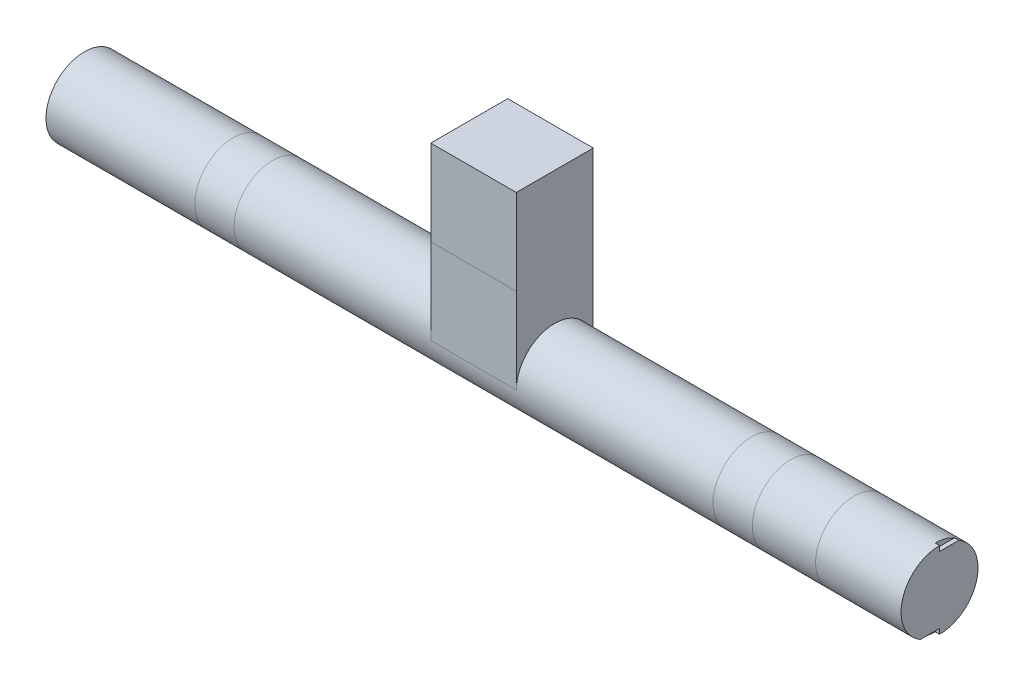
ISO-10303-21;
HEADER;
FILE_DESCRIPTION(('STEP AP214'),'2;1');
FILE_NAME('part.step','',(''),(''),'','','');
FILE_SCHEMA(('AUTOMOTIVE_DESIGN { 1 0 10303 214 1 1 1 1 }'));
ENDSEC;
DATA;
#1=APPLICATION_CONTEXT('core data for automotive mechanical design processes');
#2=APPLICATION_PROTOCOL_DEFINITION('international standard','automotive_design',2000,#1);
#3=PRODUCT_CONTEXT('',#1,'mechanical');
#4=PRODUCT('Part','Part','',(#3));
#5=PRODUCT_RELATED_PRODUCT_CATEGORY('part','',(#4));
#6=PRODUCT_DEFINITION_FORMATION('','',#4);
#7=PRODUCT_DEFINITION_CONTEXT('part definition',#1,'design');
#8=PRODUCT_DEFINITION('design','',#6,#7);
#9=PRODUCT_DEFINITION_SHAPE('','',#8);
#10=(LENGTH_UNIT() NAMED_UNIT(*) SI_UNIT(.MILLI.,.METRE.));
#11=(NAMED_UNIT(*) PLANE_ANGLE_UNIT() SI_UNIT($,.RADIAN.));
#12=(NAMED_UNIT(*) SI_UNIT($,.STERADIAN.) SOLID_ANGLE_UNIT());
#13=UNCERTAINTY_MEASURE_WITH_UNIT(LENGTH_MEASURE(1.E-05),#10,'distance_accuracy_value','');
#14=(GEOMETRIC_REPRESENTATION_CONTEXT(3) GLOBAL_UNCERTAINTY_ASSIGNED_CONTEXT((#13)) GLOBAL_UNIT_ASSIGNED_CONTEXT((#10,
#11,#12)) REPRESENTATION_CONTEXT('',''));
#15=CARTESIAN_POINT('',(0.,0.,0.));
#16=DIRECTION('',(0.,0.,1.));
#17=DIRECTION('',(1.,0.,0.));
#18=AXIS2_PLACEMENT_3D('',#15,#16,#17);
#19=CARTESIAN_POINT('',(50.,200.,45.));
#20=DIRECTION('',(0.,0.,-1.));
#21=DIRECTION('',(0.,1.,0.));
#22=AXIS2_PLACEMENT_3D('',#19,#20,#21);
#23=PLANE('',#22);
#24=DIRECTION('',(1.,0.,0.));
#25=VECTOR('',#24,1.);
#26=CARTESIAN_POINT('',(50.0000000000001,100.,45.));
#27=LINE('',#26,#25);
#28=CARTESIAN_POINT('',(-50.,100.,45.));
#29=VERTEX_POINT('',#28);
#30=CARTESIAN_POINT('',(50.,100.,45.));
#31=VERTEX_POINT('',#30);
#32=EDGE_CURVE('E297',#29,#31,#27,.T.);
#33=ORIENTED_EDGE('',*,*,#32,.F.);
#34=DIRECTION('',(0.,-1.,0.));
#35=VECTOR('',#34,1.);
#36=CARTESIAN_POINT('',(-50.,200.,45.));
#37=LINE('',#36,#35);
#38=CARTESIAN_POINT('',(-50.,0.,45.));
#39=VERTEX_POINT('',#38);
#40=EDGE_CURVE('E239',#29,#39,#37,.T.);
#41=ORIENTED_EDGE('',*,*,#40,.T.);
#42=DIRECTION('',(-1.,0.,0.));
#43=VECTOR('',#42,1.);
#44=CARTESIAN_POINT('',(50.,0.,45.));
#45=LINE('',#44,#43);
#46=CARTESIAN_POINT('',(50.,0.,45.));
#47=VERTEX_POINT('',#46);
#48=EDGE_CURVE('E256',#47,#39,#45,.T.);
#49=ORIENTED_EDGE('',*,*,#48,.F.);
#50=DIRECTION('',(0.,-1.,0.));
#51=VECTOR('',#50,1.);
#52=CARTESIAN_POINT('',(50.,200.,45.));
#53=LINE('',#52,#51);
#54=EDGE_CURVE('E229',#31,#47,#53,.T.);
#55=ORIENTED_EDGE('',*,*,#54,.F.);
#56=EDGE_LOOP('',(#33,#41,#49,#55));
#57=FACE_BOUND('',#56,.T.);
#58=ADVANCED_FACE('F49',(#57),#23,.F.);
#59=CARTESIAN_POINT('',(500.,0.,0.));
#60=DIRECTION('',(-1.,0.,0.));
#61=DIRECTION('',(0.,0.,1.));
#62=AXIS2_PLACEMENT_3D('',#59,#60,#61);
#63=CYLINDRICAL_SURFACE('',#62,45.);
#64=CARTESIAN_POINT('',(280.,0.,0.));
#65=DIRECTION('',(1.,0.,0.));
#66=DIRECTION('',(0.,0.,-1.));
#67=AXIS2_PLACEMENT_3D('',#64,#65,#66);
#68=CIRCLE('',#67,45.);
#69=CARTESIAN_POINT('',(280.,-45.,0.));
#70=VERTEX_POINT('',#69);
#71=CARTESIAN_POINT('',(280.,45.,0.));
#72=VERTEX_POINT('',#71);
#73=EDGE_CURVE('E286',#70,#72,#68,.T.);
#74=ORIENTED_EDGE('',*,*,#73,.T.);
#75=EDGE_CURVE('E291',#72,#70,#68,.T.);
#76=ORIENTED_EDGE('',*,*,#75,.T.);
#77=EDGE_LOOP('',(#74,#76));
#78=FACE_BOUND('',#77,.T.);
#79=CARTESIAN_POINT('',(326.,0.,0.));
#80=DIRECTION('',(1.,0.,0.));
#81=DIRECTION('',(0.,1.,0.));
#82=AXIS2_PLACEMENT_3D('',#79,#80,#81);
#83=CIRCLE('',#82,45.);
#84=CARTESIAN_POINT('',(326.,45.,0.));
#85=VERTEX_POINT('',#84);
#86=CARTESIAN_POINT('',(326.,-45.,0.));
#87=VERTEX_POINT('',#86);
#88=EDGE_CURVE('E296',#85,#87,#83,.T.);
#89=ORIENTED_EDGE('',*,*,#88,.F.);
#90=EDGE_CURVE('E292',#87,#85,#83,.T.);
#91=ORIENTED_EDGE('',*,*,#90,.F.);
#92=EDGE_LOOP('',(#89,#91));
#93=FACE_BOUND('',#92,.T.);
#94=ADVANCED_FACE('F321',(#78,#93),#63,.T.);
#95=DIRECTION('',(-1.,0.,0.));
#96=VECTOR('',#95,1.);
#97=CARTESIAN_POINT('',(50.,0.,-45.));
#98=LINE('',#97,#96);
#99=CARTESIAN_POINT('',(50.,0.,-45.));
#100=VERTEX_POINT('',#99);
#101=CARTESIAN_POINT('',(-50.,0.,-45.));
#102=VERTEX_POINT('',#101);
#103=EDGE_CURVE('E253',#100,#102,#98,.T.);
#104=ORIENTED_EDGE('',*,*,#103,.F.);
#105=CARTESIAN_POINT('',(50.,0.,0.));
#106=DIRECTION('',(1.,0.,0.));
#107=DIRECTION('',(0.,0.,-1.));
#108=AXIS2_PLACEMENT_3D('',#105,#106,#107);
#109=CIRCLE('',#108,45.);
#110=EDGE_CURVE('E275',#100,#47,#109,.T.);
#111=ORIENTED_EDGE('',*,*,#110,.T.);
#112=ORIENTED_EDGE('',*,*,#48,.T.);
#113=CARTESIAN_POINT('',(-50.,0.,0.));
#114=DIRECTION('',(1.,0.,0.));
#115=DIRECTION('',(0.,0.,-1.));
#116=AXIS2_PLACEMENT_3D('',#113,#114,#115);
#117=CIRCLE('',#116,45.);
#118=EDGE_CURVE('E352',#102,#39,#117,.T.);
#119=ORIENTED_EDGE('',*,*,#118,.F.);
#120=EDGE_LOOP('',(#104,#111,#112,#119));
#121=FACE_BOUND('',#120,.T.);
#122=CARTESIAN_POINT('',(-280.,0.,0.));
#123=DIRECTION('',(1.,0.,0.));
#124=DIRECTION('',(0.,0.,-1.));
#125=AXIS2_PLACEMENT_3D('',#122,#123,#124);
#126=CIRCLE('',#125,45.);
#127=CARTESIAN_POINT('',(-280.,-45.,0.));
#128=VERTEX_POINT('',#127);
#129=CARTESIAN_POINT('',(-280.,45.,0.));
#130=VERTEX_POINT('',#129);
#131=EDGE_CURVE('E281',#128,#130,#126,.T.);
#132=ORIENTED_EDGE('',*,*,#131,.T.);
#133=EDGE_CURVE('E285',#130,#128,#126,.T.);
#134=ORIENTED_EDGE('',*,*,#133,.T.);
#135=EDGE_LOOP('',(#132,#134));
#136=FACE_BOUND('',#135,.T.);
#137=ORIENTED_EDGE('',*,*,#75,.F.);
#138=ORIENTED_EDGE('',*,*,#73,.F.);
#139=EDGE_LOOP('',(#137,#138));
#140=FACE_BOUND('',#139,.T.);
#141=ADVANCED_FACE('F328',(#121,#136,#140),#63,.T.);
#142=CARTESIAN_POINT('',(-326.,0.,0.));
#143=DIRECTION('',(1.,0.,0.));
#144=DIRECTION('',(0.,0.,-1.));
#145=AXIS2_PLACEMENT_3D('',#142,#143,#144);
#146=CIRCLE('',#145,45.);
#147=CARTESIAN_POINT('',(-326.,-45.,0.));
#148=VERTEX_POINT('',#147);
#149=CARTESIAN_POINT('',(-326.,45.,0.));
#150=VERTEX_POINT('',#149);
#151=EDGE_CURVE('E269',#148,#150,#146,.T.);
#152=ORIENTED_EDGE('',*,*,#151,.T.);
#153=EDGE_CURVE('E274',#150,#148,#146,.T.);
#154=ORIENTED_EDGE('',*,*,#153,.T.);
#155=EDGE_LOOP('',(#152,#154));
#156=FACE_BOUND('',#155,.T.);
#157=ORIENTED_EDGE('',*,*,#133,.F.);
#158=ORIENTED_EDGE('',*,*,#131,.F.);
#159=EDGE_LOOP('',(#157,#158));
#160=FACE_BOUND('',#159,.T.);
#161=ADVANCED_FACE('F450',(#156,#160),#63,.T.);
#162=ORIENTED_EDGE('',*,*,#90,.T.);
#163=ORIENTED_EDGE('',*,*,#88,.T.);
#164=EDGE_LOOP('',(#162,#163));
#165=FACE_BOUND('',#164,.T.);
#166=CARTESIAN_POINT('',(400.,0.,0.));
#167=DIRECTION('',(1.,0.,0.));
#168=DIRECTION('',(0.,0.,-1.));
#169=AXIS2_PLACEMENT_3D('',#166,#167,#168);
#170=CIRCLE('',#169,45.);
#171=CARTESIAN_POINT('',(400.,45.,0.));
#172=VERTEX_POINT('',#171);
#173=CARTESIAN_POINT('',(400.,-45.,0.));
#174=VERTEX_POINT('',#173);
#175=EDGE_CURVE('E280',#172,#174,#170,.T.);
#176=ORIENTED_EDGE('',*,*,#175,.F.);
#177=EDGE_CURVE('E276',#174,#172,#170,.T.);
#178=ORIENTED_EDGE('',*,*,#177,.F.);
#179=EDGE_LOOP('',(#176,#178));
#180=FACE_BOUND('',#179,.T.);
#181=ADVANCED_FACE('F440',(#165,#180),#63,.T.);
#182=CARTESIAN_POINT('',(-500.,0.,0.));
#183=DIRECTION('',(1.,0.,0.));
#184=DIRECTION('',(0.,0.,-1.));
#185=AXIS2_PLACEMENT_3D('',#182,#183,#184);
#186=CIRCLE('',#185,45.);
#187=CARTESIAN_POINT('',(-500.,0.,-45.));
#188=VERTEX_POINT('',#187);
#189=EDGE_CURVE('E259',#188,#188,#186,.T.);
#190=ORIENTED_EDGE('',*,*,#189,.T.);
#191=EDGE_LOOP('',(#190));
#192=FACE_BOUND('',#191,.T.);
#193=ORIENTED_EDGE('',*,*,#153,.F.);
#194=ORIENTED_EDGE('',*,*,#151,.F.);
#195=EDGE_LOOP('',(#193,#194));
#196=FACE_BOUND('',#195,.T.);
#197=ADVANCED_FACE('F401',(#192,#196),#63,.T.);
#198=ORIENTED_EDGE('',*,*,#177,.T.);
#199=ORIENTED_EDGE('',*,*,#175,.T.);
#200=EDGE_LOOP('',(#198,#199));
#201=FACE_BOUND('',#200,.T.);
#202=CARTESIAN_POINT('',(495.,0.,0.));
#203=DIRECTION('',(1.,0.,0.));
#204=DIRECTION('',(0.,0.,-1.));
#205=AXIS2_PLACEMENT_3D('',#202,#203,#204);
#206=CIRCLE('',#205,45.);
#207=CARTESIAN_POINT('',(495.,39.,-22.4499443206436));
#208=VERTEX_POINT('',#207);
#209=CARTESIAN_POINT('',(495.,45.,0.));
#210=VERTEX_POINT('',#209);
#211=EDGE_CURVE('E12',#208,#210,#206,.T.);
#212=ORIENTED_EDGE('',*,*,#211,.F.);
#213=DIRECTION('',(1.,0.,0.));
#214=VECTOR('',#213,1.);
#215=CARTESIAN_POINT('',(495.,39.,-22.4499443206436));
#216=LINE('',#215,#214);
#217=CARTESIAN_POINT('',(500.,39.,-22.4499443206436));
#218=VERTEX_POINT('',#217);
#219=EDGE_CURVE('E204',#208,#218,#216,.T.);
#220=ORIENTED_EDGE('',*,*,#219,.T.);
#221=CARTESIAN_POINT('',(500.,0.,0.));
#222=DIRECTION('',(1.,0.,0.));
#223=DIRECTION('',(0.,0.,-1.));
#224=AXIS2_PLACEMENT_3D('',#221,#222,#223);
#225=CIRCLE('',#224,45.);
#226=CARTESIAN_POINT('',(500.,-45.,0.));
#227=VERTEX_POINT('',#226);
#228=EDGE_CURVE('E260',#227,#218,#225,.T.);
#229=ORIENTED_EDGE('',*,*,#228,.F.);
#230=DIRECTION('',(1.,0.,0.));
#231=VECTOR('',#230,1.);
#232=CARTESIAN_POINT('',(495.,-45.,0.));
#233=LINE('',#232,#231);
#234=CARTESIAN_POINT('',(495.,-45.,0.));
#235=VERTEX_POINT('',#234);
#236=EDGE_CURVE('E67',#235,#227,#233,.T.);
#237=ORIENTED_EDGE('',*,*,#236,.F.);
#238=CARTESIAN_POINT('',(495.,0.,0.));
#239=DIRECTION('',(1.,0.,0.));
#240=DIRECTION('',(0.,0.,-1.));
#241=AXIS2_PLACEMENT_3D('',#238,#239,#240);
#242=CIRCLE('',#241,45.);
#243=CARTESIAN_POINT('',(495.,-39.,22.4499443206436));
#244=VERTEX_POINT('',#243);
#245=EDGE_CURVE('E57',#244,#235,#242,.T.);
#246=ORIENTED_EDGE('',*,*,#245,.F.);
#247=DIRECTION('',(1.,0.,0.));
#248=VECTOR('',#247,1.);
#249=CARTESIAN_POINT('',(495.,-39.,22.4499443206436));
#250=LINE('',#249,#248);
#251=CARTESIAN_POINT('',(500.,-39.,22.4499443206436));
#252=VERTEX_POINT('',#251);
#253=EDGE_CURVE('E219',#244,#252,#250,.T.);
#254=ORIENTED_EDGE('',*,*,#253,.T.);
#255=CARTESIAN_POINT('',(500.,45.,0.));
#256=VERTEX_POINT('',#255);
#257=EDGE_CURVE('E202',#256,#252,#225,.T.);
#258=ORIENTED_EDGE('',*,*,#257,.F.);
#259=DIRECTION('',(1.,0.,0.));
#260=VECTOR('',#259,1.);
#261=CARTESIAN_POINT('',(495.,45.,0.));
#262=LINE('',#261,#260);
#263=EDGE_CURVE('E77',#210,#256,#262,.T.);
#264=ORIENTED_EDGE('',*,*,#263,.F.);
#265=EDGE_LOOP('',(#212,#220,#229,#237,#246,#254,#258,#264));
#266=FACE_BOUND('',#265,.T.);
#267=ADVANCED_FACE('F51',(#201,#266),#63,.T.);
#268=CARTESIAN_POINT('',(500.,0.,0.));
#269=DIRECTION('',(1.,0.,0.));
#270=DIRECTION('',(0.,0.,-1.));
#271=AXIS2_PLACEMENT_3D('',#268,#269,#270);
#272=PLANE('',#271);
#273=DIRECTION('',(0.,0.,-1.));
#274=VECTOR('',#273,1.);
#275=CARTESIAN_POINT('',(500.,39.,-22.4499443206436));
#276=LINE('',#275,#274);
#277=CARTESIAN_POINT('',(500.,39.,0.));
#278=VERTEX_POINT('',#277);
#279=EDGE_CURVE('E197',#278,#218,#276,.T.);
#280=ORIENTED_EDGE('',*,*,#279,.F.);
#281=DIRECTION('',(0.,-1.,0.));
#282=VECTOR('',#281,1.);
#283=CARTESIAN_POINT('',(500.,39.,0.));
#284=LINE('',#283,#282);
#285=EDGE_CURVE('E221',#256,#278,#284,.T.);
#286=ORIENTED_EDGE('',*,*,#285,.F.);
#287=ORIENTED_EDGE('',*,*,#257,.T.);
#288=DIRECTION('',(0.,0.,1.));
#289=VECTOR('',#288,1.);
#290=CARTESIAN_POINT('',(500.,-39.,22.4499443206436));
#291=LINE('',#290,#289);
#292=CARTESIAN_POINT('',(500.,-39.,0.));
#293=VERTEX_POINT('',#292);
#294=EDGE_CURVE('E213',#293,#252,#291,.T.);
#295=ORIENTED_EDGE('',*,*,#294,.F.);
#296=DIRECTION('',(0.,1.,0.));
#297=VECTOR('',#296,1.);
#298=CARTESIAN_POINT('',(500.,-39.,0.));
#299=LINE('',#298,#297);
#300=EDGE_CURVE('E216',#227,#293,#299,.T.);
#301=ORIENTED_EDGE('',*,*,#300,.F.);
#302=ORIENTED_EDGE('',*,*,#228,.T.);
#303=EDGE_LOOP('',(#280,#286,#287,#295,#301,#302));
#304=FACE_BOUND('',#303,.T.);
#305=ADVANCED_FACE('F307',(#304),#272,.T.);
#306=CARTESIAN_POINT('',(-500.,0.,0.));
#307=DIRECTION('',(1.,0.,0.));
#308=DIRECTION('',(0.,0.,-1.));
#309=AXIS2_PLACEMENT_3D('',#306,#307,#308);
#310=PLANE('',#309);
#311=ORIENTED_EDGE('',*,*,#189,.F.);
#312=EDGE_LOOP('',(#311));
#313=FACE_BOUND('',#312,.T.);
#314=ADVANCED_FACE('F334',(#313),#310,.F.);
#315=CARTESIAN_POINT('',(-50.,200.,45.));
#316=VERTEX_POINT('',#315);
#317=EDGE_CURVE('E234',#316,#29,#37,.T.);
#318=ORIENTED_EDGE('',*,*,#317,.T.);
#319=ORIENTED_EDGE('',*,*,#32,.T.);
#320=CARTESIAN_POINT('',(50.,200.,45.));
#321=VERTEX_POINT('',#320);
#322=EDGE_CURVE('E225',#321,#31,#53,.T.);
#323=ORIENTED_EDGE('',*,*,#322,.F.);
#324=DIRECTION('',(-1.,0.,0.));
#325=VECTOR('',#324,1.);
#326=CARTESIAN_POINT('',(50.,200.,45.));
#327=LINE('',#326,#325);
#328=EDGE_CURVE('E233',#321,#316,#327,.T.);
#329=ORIENTED_EDGE('',*,*,#328,.T.);
#330=EDGE_LOOP('',(#318,#319,#323,#329));
#331=FACE_BOUND('',#330,.T.);
#332=ADVANCED_FACE('F324',(#331),#23,.F.);
#333=CARTESIAN_POINT('',(50.,200.,-45.));
#334=DIRECTION('',(0.,0.,1.));
#335=DIRECTION('',(0.,-1.,0.));
#336=AXIS2_PLACEMENT_3D('',#333,#334,#335);
#337=PLANE('',#336);
#338=DIRECTION('',(0.,1.,0.));
#339=VECTOR('',#338,1.);
#340=CARTESIAN_POINT('',(-50.,200.,-45.));
#341=LINE('',#340,#339);
#342=CARTESIAN_POINT('',(-50.,200.,-45.));
#343=VERTEX_POINT('',#342);
#344=EDGE_CURVE('E238',#102,#343,#341,.T.);
#345=ORIENTED_EDGE('',*,*,#344,.T.);
#346=DIRECTION('',(-1.,0.,0.));
#347=VECTOR('',#346,1.);
#348=CARTESIAN_POINT('',(50.,200.,-45.));
#349=LINE('',#348,#347);
#350=CARTESIAN_POINT('',(50.,200.,-45.));
#351=VERTEX_POINT('',#350);
#352=EDGE_CURVE('E249',#351,#343,#349,.T.);
#353=ORIENTED_EDGE('',*,*,#352,.F.);
#354=DIRECTION('',(0.,1.,0.));
#355=VECTOR('',#354,1.);
#356=CARTESIAN_POINT('',(50.,200.,-45.));
#357=LINE('',#356,#355);
#358=EDGE_CURVE('E228',#100,#351,#357,.T.);
#359=ORIENTED_EDGE('',*,*,#358,.F.);
#360=ORIENTED_EDGE('',*,*,#103,.T.);
#361=EDGE_LOOP('',(#345,#353,#359,#360));
#362=FACE_BOUND('',#361,.T.);
#363=ADVANCED_FACE('F333',(#362),#337,.F.);
#364=CARTESIAN_POINT('',(50.,200.,45.));
#365=DIRECTION('',(0.,-1.,0.));
#366=DIRECTION('',(0.,0.,-1.));
#367=AXIS2_PLACEMENT_3D('',#364,#365,#366);
#368=PLANE('',#367);
#369=DIRECTION('',(0.,0.,1.));
#370=VECTOR('',#369,1.);
#371=CARTESIAN_POINT('',(-50.,200.,45.));
#372=LINE('',#371,#370);
#373=EDGE_CURVE('E250',#343,#316,#372,.T.);
#374=ORIENTED_EDGE('',*,*,#373,.T.);
#375=ORIENTED_EDGE('',*,*,#328,.F.);
#376=DIRECTION('',(0.,0.,1.));
#377=VECTOR('',#376,1.);
#378=CARTESIAN_POINT('',(50.,200.,45.));
#379=LINE('',#378,#377);
#380=EDGE_CURVE('E231',#351,#321,#379,.T.);
#381=ORIENTED_EDGE('',*,*,#380,.F.);
#382=ORIENTED_EDGE('',*,*,#352,.T.);
#383=EDGE_LOOP('',(#374,#375,#381,#382));
#384=FACE_BOUND('',#383,.T.);
#385=ADVANCED_FACE('F340',(#384),#368,.F.);
#386=CARTESIAN_POINT('',(50.,0.,0.));
#387=DIRECTION('',(1.,0.,0.));
#388=DIRECTION('',(0.,0.,-1.));
#389=AXIS2_PLACEMENT_3D('',#386,#387,#388);
#390=PLANE('',#389);
#391=ORIENTED_EDGE('',*,*,#110,.F.);
#392=ORIENTED_EDGE('',*,*,#358,.T.);
#393=ORIENTED_EDGE('',*,*,#380,.T.);
#394=ORIENTED_EDGE('',*,*,#322,.T.);
#395=ORIENTED_EDGE('',*,*,#54,.T.);
#396=EDGE_LOOP('',(#391,#392,#393,#394,#395));
#397=FACE_BOUND('',#396,.T.);
#398=ADVANCED_FACE('F412',(#397),#390,.T.);
#399=CARTESIAN_POINT('',(-50.,0.,0.));
#400=DIRECTION('',(1.,0.,0.));
#401=DIRECTION('',(0.,0.,-1.));
#402=AXIS2_PLACEMENT_3D('',#399,#400,#401);
#403=PLANE('',#402);
#404=ORIENTED_EDGE('',*,*,#344,.F.);
#405=ORIENTED_EDGE('',*,*,#118,.T.);
#406=ORIENTED_EDGE('',*,*,#40,.F.);
#407=ORIENTED_EDGE('',*,*,#317,.F.);
#408=ORIENTED_EDGE('',*,*,#373,.F.);
#409=EDGE_LOOP('',(#404,#405,#406,#407,#408));
#410=FACE_BOUND('',#409,.T.);
#411=ADVANCED_FACE('F318',(#410),#403,.F.);
#412=CARTESIAN_POINT('',(495.,0.,0.));
#413=DIRECTION('',(1.,0.,0.));
#414=DIRECTION('',(0.,0.,-1.));
#415=AXIS2_PLACEMENT_3D('',#412,#413,#414);
#416=PLANE('',#415);
#417=ORIENTED_EDGE('',*,*,#245,.T.);
#418=DIRECTION('',(0.,1.,0.));
#419=VECTOR('',#418,1.);
#420=CARTESIAN_POINT('',(495.,-39.,0.));
#421=LINE('',#420,#419);
#422=CARTESIAN_POINT('',(495.,-39.,0.));
#423=VERTEX_POINT('',#422);
#424=EDGE_CURVE('E209',#235,#423,#421,.T.);
#425=ORIENTED_EDGE('',*,*,#424,.T.);
#426=DIRECTION('',(0.,0.,1.));
#427=VECTOR('',#426,1.);
#428=CARTESIAN_POINT('',(495.,-39.,22.4499443206436));
#429=LINE('',#428,#427);
#430=EDGE_CURVE('E212',#423,#244,#429,.T.);
#431=ORIENTED_EDGE('',*,*,#430,.T.);
#432=EDGE_LOOP('',(#417,#425,#431));
#433=FACE_BOUND('',#432,.T.);
#434=ADVANCED_FACE('F301',(#433),#416,.T.);
#435=CARTESIAN_POINT('',(495.,-39.,22.4499443206436));
#436=DIRECTION('',(0.,1.,0.));
#437=DIRECTION('',(0.,0.,1.));
#438=AXIS2_PLACEMENT_3D('',#435,#436,#437);
#439=PLANE('',#438);
#440=ORIENTED_EDGE('',*,*,#294,.T.);
#441=ORIENTED_EDGE('',*,*,#253,.F.);
#442=ORIENTED_EDGE('',*,*,#430,.F.);
#443=DIRECTION('',(1.,0.,0.));
#444=VECTOR('',#443,1.);
#445=CARTESIAN_POINT('',(495.,-39.,0.));
#446=LINE('',#445,#444);
#447=EDGE_CURVE('E222',#423,#293,#446,.T.);
#448=ORIENTED_EDGE('',*,*,#447,.T.);
#449=EDGE_LOOP('',(#440,#441,#442,#448));
#450=FACE_BOUND('',#449,.T.);
#451=ADVANCED_FACE('F310',(#450),#439,.F.);
#452=CARTESIAN_POINT('',(495.,-39.,0.));
#453=DIRECTION('',(0.,0.,-1.));
#454=DIRECTION('',(0.,1.,0.));
#455=AXIS2_PLACEMENT_3D('',#452,#453,#454);
#456=PLANE('',#455);
#457=ORIENTED_EDGE('',*,*,#300,.T.);
#458=ORIENTED_EDGE('',*,*,#447,.F.);
#459=ORIENTED_EDGE('',*,*,#424,.F.);
#460=ORIENTED_EDGE('',*,*,#236,.T.);
#461=EDGE_LOOP('',(#457,#458,#459,#460));
#462=FACE_BOUND('',#461,.T.);
#463=ADVANCED_FACE('F303',(#462),#456,.F.);
#464=CARTESIAN_POINT('',(495.,0.,0.));
#465=DIRECTION('',(1.,0.,0.));
#466=DIRECTION('',(0.,0.,-1.));
#467=AXIS2_PLACEMENT_3D('',#464,#465,#466);
#468=PLANE('',#467);
#469=ORIENTED_EDGE('',*,*,#211,.T.);
#470=DIRECTION('',(0.,-1.,0.));
#471=VECTOR('',#470,1.);
#472=CARTESIAN_POINT('',(495.,39.,0.));
#473=LINE('',#472,#471);
#474=CARTESIAN_POINT('',(495.,39.,0.));
#475=VERTEX_POINT('',#474);
#476=EDGE_CURVE('E190',#210,#475,#473,.T.);
#477=ORIENTED_EDGE('',*,*,#476,.T.);
#478=DIRECTION('',(0.,0.,-1.));
#479=VECTOR('',#478,1.);
#480=CARTESIAN_POINT('',(495.,39.,-22.4499443206436));
#481=LINE('',#480,#479);
#482=EDGE_CURVE('E192',#475,#208,#481,.T.);
#483=ORIENTED_EDGE('',*,*,#482,.T.);
#484=EDGE_LOOP('',(#469,#477,#483));
#485=FACE_BOUND('',#484,.T.);
#486=ADVANCED_FACE('F189',(#485),#468,.T.);
#487=CARTESIAN_POINT('',(495.,39.,-22.4499443206436));
#488=DIRECTION('',(0.,-1.,0.));
#489=DIRECTION('',(0.,0.,-1.));
#490=AXIS2_PLACEMENT_3D('',#487,#488,#489);
#491=PLANE('',#490);
#492=ORIENTED_EDGE('',*,*,#279,.T.);
#493=ORIENTED_EDGE('',*,*,#219,.F.);
#494=ORIENTED_EDGE('',*,*,#482,.F.);
#495=DIRECTION('',(1.,0.,0.));
#496=VECTOR('',#495,1.);
#497=CARTESIAN_POINT('',(495.,39.,0.));
#498=LINE('',#497,#496);
#499=EDGE_CURVE('E196',#475,#278,#498,.T.);
#500=ORIENTED_EDGE('',*,*,#499,.T.);
#501=EDGE_LOOP('',(#492,#493,#494,#500));
#502=FACE_BOUND('',#501,.T.);
#503=ADVANCED_FACE('F357',(#502),#491,.F.);
#504=CARTESIAN_POINT('',(495.,39.,0.));
#505=DIRECTION('',(0.,0.,1.));
#506=DIRECTION('',(1.,0.,0.));
#507=AXIS2_PLACEMENT_3D('',#504,#505,#506);
#508=PLANE('',#507);
#509=ORIENTED_EDGE('',*,*,#285,.T.);
#510=ORIENTED_EDGE('',*,*,#499,.F.);
#511=ORIENTED_EDGE('',*,*,#476,.F.);
#512=ORIENTED_EDGE('',*,*,#263,.T.);
#513=EDGE_LOOP('',(#509,#510,#511,#512));
#514=FACE_BOUND('',#513,.T.);
#515=ADVANCED_FACE('F195',(#514),#508,.F.);
#516=CLOSED_SHELL('',(#58,#94,#141,#161,#181,#197,#267,#305,#314,#332,#363,#385,#398,#411,#434,
#451,#463,#486,#503,#515));
#517=MANIFOLD_SOLID_BREP('B2',#516);
#518=ADVANCED_BREP_SHAPE_REPRESENTATION('',(#18,#517),#14);
#519=SHAPE_DEFINITION_REPRESENTATION(#9,#518);
ENDSEC;
END-ISO-10303-21;
